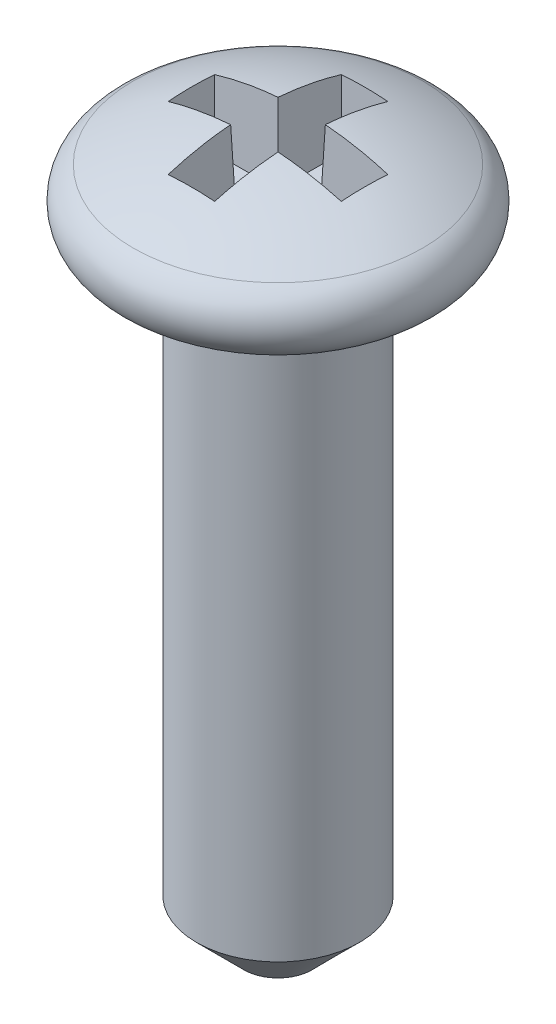
ISO-10303-21;
HEADER;
FILE_DESCRIPTION(('STEP AP214'),'2;1');
FILE_NAME('part.step','',(''),(''),'','','');
FILE_SCHEMA(('AUTOMOTIVE_DESIGN { 1 0 10303 214 1 1 1 1 }'));
ENDSEC;
DATA;
#1=APPLICATION_CONTEXT('core data for automotive mechanical design processes');
#2=APPLICATION_PROTOCOL_DEFINITION('international standard','automotive_design',2000,#1);
#3=PRODUCT_CONTEXT('',#1,'mechanical');
#4=PRODUCT('Part','Part','',(#3));
#5=PRODUCT_RELATED_PRODUCT_CATEGORY('part','',(#4));
#6=PRODUCT_DEFINITION_FORMATION('','',#4);
#7=PRODUCT_DEFINITION_CONTEXT('part definition',#1,'design');
#8=PRODUCT_DEFINITION('design','',#6,#7);
#9=PRODUCT_DEFINITION_SHAPE('','',#8);
#10=(LENGTH_UNIT() NAMED_UNIT(*) SI_UNIT(.MILLI.,.METRE.));
#11=(NAMED_UNIT(*) PLANE_ANGLE_UNIT() SI_UNIT($,.RADIAN.));
#12=(NAMED_UNIT(*) SI_UNIT($,.STERADIAN.) SOLID_ANGLE_UNIT());
#13=UNCERTAINTY_MEASURE_WITH_UNIT(LENGTH_MEASURE(1.E-05),#10,'distance_accuracy_value','');
#14=(GEOMETRIC_REPRESENTATION_CONTEXT(3) GLOBAL_UNCERTAINTY_ASSIGNED_CONTEXT((#13)) GLOBAL_UNIT_ASSIGNED_CONTEXT((#10,
#11,#12)) REPRESENTATION_CONTEXT('',''));
#15=CARTESIAN_POINT('',(0.,0.,0.));
#16=DIRECTION('',(0.,0.,1.));
#17=DIRECTION('',(1.,0.,0.));
#18=AXIS2_PLACEMENT_3D('',#15,#16,#17);
#19=CARTESIAN_POINT('',(0.,10.2362,0.));
#20=DIRECTION('',(0.,1.,0.));
#21=DIRECTION('',(0.,0.,1.));
#22=AXIS2_PLACEMENT_3D('',#19,#20,#21);
#23=PLANE('',#22);
#24=DIRECTION('',(0.,0.,1.));
#25=VECTOR('',#24,1.);
#26=CARTESIAN_POINT('',(0.33665062274548,10.2362,1.397));
#27=LINE('',#26,#25);
#28=CARTESIAN_POINT('',(0.336650622745487,10.2362,1.35265062274548));
#29=VERTEX_POINT('',#28);
#30=CARTESIAN_POINT('',(0.33665062274548,10.2362,0.336650622745488));
#31=VERTEX_POINT('',#30);
#32=EDGE_CURVE('E341',#29,#31,#27,.F.);
#33=ORIENTED_EDGE('',*,*,#32,.T.);
#34=DIRECTION('',(1.,0.,0.));
#35=VECTOR('',#34,1.);
#36=CARTESIAN_POINT('',(0.381,10.2362,0.33665062274548));
#37=LINE('',#36,#35);
#38=CARTESIAN_POINT('',(1.35265062274549,10.2362,0.336650622745481));
#39=VERTEX_POINT('',#38);
#40=EDGE_CURVE('E347',#31,#39,#37,.T.);
#41=ORIENTED_EDGE('',*,*,#40,.T.);
#42=DIRECTION('',(0.,0.,1.));
#43=VECTOR('',#42,1.);
#44=CARTESIAN_POINT('',(1.35265062274548,10.2362,0.381));
#45=LINE('',#44,#43);
#46=CARTESIAN_POINT('',(1.35265062274548,10.2362,-0.336650622745487));
#47=VERTEX_POINT('',#46);
#48=EDGE_CURVE('E300',#39,#47,#45,.F.);
#49=ORIENTED_EDGE('',*,*,#48,.T.);
#50=DIRECTION('',(1.,0.,0.));
#51=VECTOR('',#50,1.);
#52=CARTESIAN_POINT('',(1.397,10.2362,-0.33665062274548));
#53=LINE('',#52,#51);
#54=CARTESIAN_POINT('',(0.336650622745481,10.2362,-0.336650622745484));
#55=VERTEX_POINT('',#54);
#56=EDGE_CURVE('E130',#47,#55,#53,.F.);
#57=ORIENTED_EDGE('',*,*,#56,.T.);
#58=DIRECTION('',(0.,0.,1.));
#59=VECTOR('',#58,1.);
#60=CARTESIAN_POINT('',(0.33665062274548,10.2362,-0.381));
#61=LINE('',#60,#59);
#62=CARTESIAN_POINT('',(0.33665062274548,10.2362,-1.35265062274548));
#63=VERTEX_POINT('',#62);
#64=EDGE_CURVE('E127',#55,#63,#61,.F.);
#65=ORIENTED_EDGE('',*,*,#64,.T.);
#66=DIRECTION('',(1.,0.,0.));
#67=VECTOR('',#66,1.);
#68=CARTESIAN_POINT('',(0.381,10.2362,-1.35265062274548));
#69=LINE('',#68,#67);
#70=CARTESIAN_POINT('',(-0.336650622745485,10.2362,-1.35265062274548));
#71=VERTEX_POINT('',#70);
#72=EDGE_CURVE('E148',#63,#71,#69,.F.);
#73=ORIENTED_EDGE('',*,*,#72,.T.);
#74=DIRECTION('',(0.,0.,1.));
#75=VECTOR('',#74,1.);
#76=CARTESIAN_POINT('',(-0.33665062274548,10.2362,-1.397));
#77=LINE('',#76,#75);
#78=CARTESIAN_POINT('',(-0.33665062274548,10.2362,-0.336650622745488));
#79=VERTEX_POINT('',#78);
#80=EDGE_CURVE('E190',#71,#79,#77,.T.);
#81=ORIENTED_EDGE('',*,*,#80,.T.);
#82=DIRECTION('',(1.,0.,0.));
#83=VECTOR('',#82,1.);
#84=CARTESIAN_POINT('',(-0.381,10.2362,-0.33665062274548));
#85=LINE('',#84,#83);
#86=CARTESIAN_POINT('',(-1.35265062274549,10.2362,-0.33665062274548));
#87=VERTEX_POINT('',#86);
#88=EDGE_CURVE('E195',#79,#87,#85,.F.);
#89=ORIENTED_EDGE('',*,*,#88,.T.);
#90=DIRECTION('',(0.,0.,1.));
#91=VECTOR('',#90,1.);
#92=CARTESIAN_POINT('',(-1.35265062274548,10.2362,-0.381));
#93=LINE('',#92,#91);
#94=CARTESIAN_POINT('',(-1.35265062274548,10.2362,0.336650622745487));
#95=VERTEX_POINT('',#94);
#96=EDGE_CURVE('E200',#87,#95,#93,.T.);
#97=ORIENTED_EDGE('',*,*,#96,.T.);
#98=DIRECTION('',(1.,0.,0.));
#99=VECTOR('',#98,1.);
#100=CARTESIAN_POINT('',(-1.397,10.2362,0.33665062274548));
#101=LINE('',#100,#99);
#102=CARTESIAN_POINT('',(-0.336650622745488,10.2362,0.33665062274548));
#103=VERTEX_POINT('',#102);
#104=EDGE_CURVE('E323',#95,#103,#101,.T.);
#105=ORIENTED_EDGE('',*,*,#104,.T.);
#106=DIRECTION('',(0.,0.,1.));
#107=VECTOR('',#106,1.);
#108=CARTESIAN_POINT('',(-0.33665062274548,10.2362,0.381));
#109=LINE('',#108,#107);
#110=CARTESIAN_POINT('',(-0.33665062274548,10.2362,1.35265062274549));
#111=VERTEX_POINT('',#110);
#112=EDGE_CURVE('E329',#103,#111,#109,.T.);
#113=ORIENTED_EDGE('',*,*,#112,.T.);
#114=DIRECTION('',(1.,0.,0.));
#115=VECTOR('',#114,1.);
#116=CARTESIAN_POINT('',(-0.381,10.2362,1.35265062274548));
#117=LINE('',#116,#115);
#118=EDGE_CURVE('E335',#111,#29,#117,.T.);
#119=ORIENTED_EDGE('',*,*,#118,.T.);
#120=EDGE_LOOP('',(#33,#41,#49,#57,#65,#73,#81,#89,#97,#105,#113,#119));
#121=FACE_BOUND('',#120,.T.);
#122=ADVANCED_FACE('F15',(#121),#23,.T.);
#123=CARTESIAN_POINT('',(0.381,11.5062,-0.381));
#124=DIRECTION('',(0.999390827019096,-0.034899496702501,0.));
#125=DIRECTION('',(0.034899496702501,0.999390827019096,0.));
#126=AXIS2_PLACEMENT_3D('',#123,#124,#125);
#127=PLANE('',#126);
#128=DIRECTION('',(0.0348782627423748,0.998782765958718,-0.0348782627423746));
#129=VECTOR('',#128,1.);
#130=CARTESIAN_POINT('',(0.336650622745481,10.2362,-0.33665062274548));
#131=LINE('',#130,#129);
#132=CARTESIAN_POINT('',(0.379970746913043,11.4767260479097,-0.379970746913043));
#133=VERTEX_POINT('',#132);
#134=EDGE_CURVE('E124',#55,#133,#131,.T.);
#135=ORIENTED_EDGE('',*,*,#134,.T.);
#136=CARTESIAN_POINT('',(0.373478376351118,11.2908088800918,-1.38947837635112));
#137=CARTESIAN_POINT('',(0.375176080368759,11.3394247623405,-1.22447785640432));
#138=CARTESIAN_POINT('',(0.376565963257741,11.379225800783,-1.05785196064441));
#139=CARTESIAN_POINT('',(0.378730086778386,11.4411981900556,-0.721349417498387));
#140=CARTESIAN_POINT('',(0.379504327410048,11.4633695408857,-0.551472770112268));
#141=CARTESIAN_POINT('',(0.379970746913051,11.4767260479097,-0.379970746913042));
#142=B_SPLINE_CURVE_WITH_KNOTS('',3,(#136,#137,#138,#139,#140,#141),.UNSPECIFIED.,.F.,.F.,(4,2,
4),(0.,0.513957383602987,1.02791476720597),.UNSPECIFIED.);
#143=CARTESIAN_POINT('',(0.373478376351117,11.2908088800918,-1.38947837635112));
#144=VERTEX_POINT('',#143);
#145=EDGE_CURVE('E121',#144,#133,#142,.T.);
#146=ORIENTED_EDGE('',*,*,#145,.F.);
#147=DIRECTION('',(-0.0348782627423746,-0.998782765958718,0.0348782627423746));
#148=VECTOR('',#147,1.);
#149=CARTESIAN_POINT('',(0.373478376351117,11.2908088800918,-1.38947837635112));
#150=LINE('',#149,#148);
#151=EDGE_CURVE('E151',#144,#63,#150,.T.);
#152=ORIENTED_EDGE('',*,*,#151,.T.);
#153=ORIENTED_EDGE('',*,*,#64,.F.);
#154=EDGE_LOOP('',(#135,#146,#152,#153));
#155=FACE_BOUND('',#154,.T.);
#156=ADVANCED_FACE('F126',(#155),#127,.F.);
#157=CARTESIAN_POINT('',(1.397,11.5062,-0.381));
#158=DIRECTION('',(0.,-0.034899496702501,-0.999390827019096));
#159=DIRECTION('',(0.,0.999390827019096,-0.034899496702501));
#160=AXIS2_PLACEMENT_3D('',#157,#158,#159);
#161=PLANE('',#160);
#162=DIRECTION('',(0.0348782627423746,0.998782765958718,-0.034878262742374));
#163=VECTOR('',#162,1.);
#164=CARTESIAN_POINT('',(1.35265062274548,10.2362,-0.33665062274549));
#165=LINE('',#164,#163);
#166=CARTESIAN_POINT('',(1.38947837635112,11.2908088800918,-0.373478376351126));
#167=VERTEX_POINT('',#166);
#168=EDGE_CURVE('E136',#47,#167,#165,.T.);
#169=ORIENTED_EDGE('',*,*,#168,.T.);
#170=CARTESIAN_POINT('',(0.379970746913042,11.4767260479097,-0.379970746913042));
#171=CARTESIAN_POINT('',(0.551472770112267,11.4633695408857,-0.379504327410043));
#172=CARTESIAN_POINT('',(0.721349417498385,11.4411981900556,-0.378730086778384));
#173=CARTESIAN_POINT('',(1.05785196064441,11.379225800783,-0.376565963257743));
#174=CARTESIAN_POINT('',(1.22447785640432,11.3394247623405,-0.375176080368762));
#175=CARTESIAN_POINT('',(1.38947837635112,11.2908088800918,-0.37347837635112));
#176=B_SPLINE_CURVE_WITH_KNOTS('',3,(#170,#171,#172,#173,#174,#175),.UNSPECIFIED.,.F.,.F.,(4,2,
4),(0.,0.513957383602985,1.02791476720597),.UNSPECIFIED.);
#177=EDGE_CURVE('E133',#133,#167,#176,.T.);
#178=ORIENTED_EDGE('',*,*,#177,.F.);
#179=ORIENTED_EDGE('',*,*,#134,.F.);
#180=ORIENTED_EDGE('',*,*,#56,.F.);
#181=EDGE_LOOP('',(#169,#178,#179,#180));
#182=FACE_BOUND('',#181,.T.);
#183=ADVANCED_FACE('F134',(#182),#161,.F.);
#184=CARTESIAN_POINT('',(1.397,11.5062,0.381));
#185=DIRECTION('',(0.999390827019096,-0.034899496702501,0.));
#186=DIRECTION('',(0.034899496702501,0.999390827019096,0.));
#187=AXIS2_PLACEMENT_3D('',#184,#185,#186);
#188=PLANE('',#187);
#189=DIRECTION('',(0.0348782627423739,0.998782765958718,0.0348782627423746));
#190=VECTOR('',#189,1.);
#191=CARTESIAN_POINT('',(1.35265062274549,10.2362,0.336650622745481));
#192=LINE('',#191,#190);
#193=CARTESIAN_POINT('',(1.38947837635112,11.2908088800918,0.373478376351117));
#194=VERTEX_POINT('',#193);
#195=EDGE_CURVE('E350',#39,#194,#192,.T.);
#196=ORIENTED_EDGE('',*,*,#195,.T.);
#197=CARTESIAN_POINT('',(1.3899907102025,11.3054802020253,0.));
#198=CARTESIAN_POINT('',(1.38999061133248,11.3054773707585,0.187027594424087));
#199=CARTESIAN_POINT('',(1.38947837635112,11.2908088800918,0.373478376351117));
#200=B_SPLINE_CURVE_WITH_KNOTS('',2,(#197,#198,#199),.UNSPECIFIED.,.F.,.F.,(3,3),(0.,1.),.UNSPECIFIED.);
#201=CARTESIAN_POINT('',(1.3899907102025,11.3054802020253,0.));
#202=VERTEX_POINT('',#201);
#203=EDGE_CURVE('E284',#202,#194,#200,.T.);
#204=ORIENTED_EDGE('',*,*,#203,.F.);
#205=CARTESIAN_POINT('',(1.38947837635112,11.2908088800918,-0.373478376351126));
#206=CARTESIAN_POINT('',(1.38999061133248,11.3054773707585,-0.187027594424157));
#207=CARTESIAN_POINT('',(1.3899907102025,11.3054802020253,0.));
#208=B_SPLINE_CURVE_WITH_KNOTS('',2,(#205,#206,#207),.UNSPECIFIED.,.F.,.F.,(3,3),(0.,1.),.UNSPECIFIED.);
#209=EDGE_CURVE('E140',#167,#202,#208,.T.);
#210=ORIENTED_EDGE('',*,*,#209,.F.);
#211=ORIENTED_EDGE('',*,*,#168,.F.);
#212=ORIENTED_EDGE('',*,*,#48,.F.);
#213=EDGE_LOOP('',(#196,#204,#210,#211,#212));
#214=FACE_BOUND('',#213,.T.);
#215=ADVANCED_FACE('F276',(#214),#188,.F.);
#216=CARTESIAN_POINT('',(0.381,11.5062,0.381));
#217=DIRECTION('',(0.,-0.034899496702501,0.999390827019096));
#218=DIRECTION('',(0.,-0.999390827019096,-0.034899496702501));
#219=AXIS2_PLACEMENT_3D('',#216,#217,#218);
#220=PLANE('',#219);
#221=DIRECTION('',(0.0348782627423746,0.998782765958718,0.034878262742368));
#222=VECTOR('',#221,1.);
#223=CARTESIAN_POINT('',(0.33665062274548,10.2362,0.336650622745491));
#224=LINE('',#223,#222);
#225=CARTESIAN_POINT('',(0.379970746913042,11.4767260479097,0.379970746913045));
#226=VERTEX_POINT('',#225);
#227=EDGE_CURVE('E344',#31,#226,#224,.T.);
#228=ORIENTED_EDGE('',*,*,#227,.T.);
#229=CARTESIAN_POINT('',(1.38947837635112,11.2908088800918,0.373478376351117));
#230=CARTESIAN_POINT('',(1.22447785640434,11.3394247623405,0.375176080368769));
#231=CARTESIAN_POINT('',(1.05785196064444,11.379225800783,0.376565963257751));
#232=CARTESIAN_POINT('',(0.721349417498445,11.4411981900556,0.378730086778376));
#233=CARTESIAN_POINT('',(0.55147277011234,11.4633695408857,0.379504327410018));
#234=CARTESIAN_POINT('',(0.379970746913129,11.4767260479097,0.379970746912991));
#235=B_SPLINE_CURVE_WITH_KNOTS('',3,(#229,#230,#231,#232,#233,#234),.UNSPECIFIED.,.F.,.F.,(4,2,
4),(0.,0.513957383602946,1.02791476720589),.UNSPECIFIED.);
#236=EDGE_CURVE('E279',#194,#226,#235,.T.);
#237=ORIENTED_EDGE('',*,*,#236,.F.);
#238=ORIENTED_EDGE('',*,*,#195,.F.);
#239=ORIENTED_EDGE('',*,*,#40,.F.);
#240=EDGE_LOOP('',(#228,#237,#238,#239));
#241=FACE_BOUND('',#240,.T.);
#242=ADVANCED_FACE('F271',(#241),#220,.F.);
#243=CARTESIAN_POINT('',(0.381,11.5062,1.397));
#244=DIRECTION('',(0.999390827019096,-0.034899496702501,0.));
#245=DIRECTION('',(0.034899496702501,0.999390827019096,0.));
#246=AXIS2_PLACEMENT_3D('',#243,#244,#245);
#247=PLANE('',#246);
#248=DIRECTION('',(0.0348782627423741,0.998782765958718,0.0348782627423747));
#249=VECTOR('',#248,1.);
#250=CARTESIAN_POINT('',(0.33665062274549,10.2362,1.35265062274548));
#251=LINE('',#250,#249);
#252=CARTESIAN_POINT('',(0.373478376351126,11.2908088800918,1.38947837635112));
#253=VERTEX_POINT('',#252);
#254=EDGE_CURVE('E338',#29,#253,#251,.T.);
#255=ORIENTED_EDGE('',*,*,#254,.T.);
#256=CARTESIAN_POINT('',(0.379970746913042,11.4767260479097,0.379970746913044));
#257=CARTESIAN_POINT('',(0.379504327410044,11.4633695408857,0.551472770112269));
#258=CARTESIAN_POINT('',(0.378730086778384,11.4411981900556,0.721349417498387));
#259=CARTESIAN_POINT('',(0.376565963257743,11.379225800783,1.05785196064441));
#260=CARTESIAN_POINT('',(0.375176080368761,11.3394247623405,1.22447785640432));
#261=CARTESIAN_POINT('',(0.373478376351118,11.2908088800918,1.38947837635112));
#262=B_SPLINE_CURVE_WITH_KNOTS('',3,(#256,#257,#258,#259,#260,#261),.UNSPECIFIED.,.F.,.F.,(4,2,
4),(0.,0.513957383602984,1.02791476720597),.UNSPECIFIED.);
#263=EDGE_CURVE('E258',#226,#253,#262,.T.);
#264=ORIENTED_EDGE('',*,*,#263,.F.);
#265=ORIENTED_EDGE('',*,*,#227,.F.);
#266=ORIENTED_EDGE('',*,*,#32,.F.);
#267=EDGE_LOOP('',(#255,#264,#265,#266));
#268=FACE_BOUND('',#267,.T.);
#269=ADVANCED_FACE('F266',(#268),#247,.F.);
#270=CARTESIAN_POINT('',(-0.381,11.5062,1.397));
#271=DIRECTION('',(0.,-0.034899496702501,0.999390827019096));
#272=DIRECTION('',(0.,-0.999390827019096,-0.034899496702501));
#273=AXIS2_PLACEMENT_3D('',#270,#271,#272);
#274=PLANE('',#273);
#275=DIRECTION('',(-0.0348782627423746,0.998782765958718,0.0348782627423739));
#276=VECTOR('',#275,1.);
#277=CARTESIAN_POINT('',(-0.33665062274548,10.2362,1.35265062274549));
#278=LINE('',#277,#276);
#279=CARTESIAN_POINT('',(-0.373478376351117,11.2908088800918,1.38947837635112));
#280=VERTEX_POINT('',#279);
#281=EDGE_CURVE('E332',#111,#280,#278,.T.);
#282=ORIENTED_EDGE('',*,*,#281,.T.);
#283=CARTESIAN_POINT('',(0.373478376351126,11.2908088800918,1.38947837635112));
#284=CARTESIAN_POINT('',(0.248985584234086,11.3005897613808,1.38981993225204));
#285=CARTESIAN_POINT('',(0.124492792117045,11.3054802020253,1.3899907102025));
#286=CARTESIAN_POINT('',(-0.124492792117036,11.3054802020253,1.3899907102025));
#287=CARTESIAN_POINT('',(-0.248985584234077,11.3005897613808,1.38981993225204));
#288=CARTESIAN_POINT('',(-0.373478376351117,11.2908088800918,1.38947837635112));
#289=B_SPLINE_CURVE_WITH_KNOTS('',3,(#283,#284,#285,#286,#287,#288),.UNSPECIFIED.,.F.,.F.,(4,2,
4),(0.,0.373766782599955,0.747533565199911),.UNSPECIFIED.);
#290=EDGE_CURVE('E252',#253,#280,#289,.T.);
#291=ORIENTED_EDGE('',*,*,#290,.F.);
#292=ORIENTED_EDGE('',*,*,#254,.F.);
#293=ORIENTED_EDGE('',*,*,#118,.F.);
#294=EDGE_LOOP('',(#282,#291,#292,#293));
#295=FACE_BOUND('',#294,.T.);
#296=ADVANCED_FACE('F263',(#295),#274,.F.);
#297=CARTESIAN_POINT('',(-0.381,11.5062,0.381));
#298=DIRECTION('',(-0.999390827019096,-0.034899496702501,0.));
#299=DIRECTION('',(0.034899496702501,-0.999390827019096,0.));
#300=AXIS2_PLACEMENT_3D('',#297,#298,#299);
#301=PLANE('',#300);
#302=DIRECTION('',(-0.034878262742368,0.998782765958718,0.0348782627423746));
#303=VECTOR('',#302,1.);
#304=CARTESIAN_POINT('',(-0.336650622745491,10.2362,0.33665062274548));
#305=LINE('',#304,#303);
#306=CARTESIAN_POINT('',(-0.379970746913045,11.4767260479097,0.379970746913043));
#307=VERTEX_POINT('',#306);
#308=EDGE_CURVE('E326',#103,#307,#305,.T.);
#309=ORIENTED_EDGE('',*,*,#308,.T.);
#310=CARTESIAN_POINT('',(-0.373478376351117,11.2908088800918,1.38947837635112));
#311=CARTESIAN_POINT('',(-0.37517608036876,11.3394247623405,1.22447785640432));
#312=CARTESIAN_POINT('',(-0.376565963257743,11.379225800783,1.05785196064442));
#313=CARTESIAN_POINT('',(-0.378730086778385,11.4411981900556,0.721349417498389));
#314=CARTESIAN_POINT('',(-0.379504327410044,11.4633695408857,0.551472770112269));
#315=CARTESIAN_POINT('',(-0.379970746913043,11.4767260479097,0.379970746913043));
#316=B_SPLINE_CURVE_WITH_KNOTS('',3,(#310,#311,#312,#313,#314,#315),.UNSPECIFIED.,.F.,.F.,(4,2,
4),(0.,0.513957383602989,1.02791476720598),.UNSPECIFIED.);
#317=EDGE_CURVE('E241',#280,#307,#316,.T.);
#318=ORIENTED_EDGE('',*,*,#317,.F.);
#319=ORIENTED_EDGE('',*,*,#281,.F.);
#320=ORIENTED_EDGE('',*,*,#112,.F.);
#321=EDGE_LOOP('',(#309,#318,#319,#320));
#322=FACE_BOUND('',#321,.T.);
#323=ADVANCED_FACE('F230',(#322),#301,.F.);
#324=CARTESIAN_POINT('',(-1.397,11.5062,0.381));
#325=DIRECTION('',(0.,-0.034899496702501,0.999390827019096));
#326=DIRECTION('',(0.,-0.999390827019096,-0.034899496702501));
#327=AXIS2_PLACEMENT_3D('',#324,#325,#326);
#328=PLANE('',#327);
#329=DIRECTION('',(-0.0348782627423746,0.998782765958718,0.034878262742374));
#330=VECTOR('',#329,1.);
#331=CARTESIAN_POINT('',(-1.35265062274548,10.2362,0.33665062274549));
#332=LINE('',#331,#330);
#333=CARTESIAN_POINT('',(-1.38947837635112,11.2908088800918,0.373478376351126));
#334=VERTEX_POINT('',#333);
#335=EDGE_CURVE('E320',#95,#334,#332,.T.);
#336=ORIENTED_EDGE('',*,*,#335,.T.);
#337=CARTESIAN_POINT('',(-0.379970746913044,11.4767260479097,0.379970746913043));
#338=CARTESIAN_POINT('',(-0.551472770112269,11.4633695408857,0.379504327410044));
#339=CARTESIAN_POINT('',(-0.721349417498387,11.4411981900556,0.378730086778385));
#340=CARTESIAN_POINT('',(-1.05785196064441,11.379225800783,0.376565963257743));
#341=CARTESIAN_POINT('',(-1.22447785640432,11.3394247623405,0.37517608036876));
#342=CARTESIAN_POINT('',(-1.38947837635112,11.2908088800918,0.373478376351117));
#343=B_SPLINE_CURVE_WITH_KNOTS('',3,(#337,#338,#339,#340,#341,#342),.UNSPECIFIED.,.F.,.F.,(4,2,
4),(0.,0.513957383602984,1.02791476720597),.UNSPECIFIED.);
#344=EDGE_CURVE('E209',#307,#334,#343,.T.);
#345=ORIENTED_EDGE('',*,*,#344,.F.);
#346=ORIENTED_EDGE('',*,*,#308,.F.);
#347=ORIENTED_EDGE('',*,*,#104,.F.);
#348=EDGE_LOOP('',(#336,#345,#346,#347));
#349=FACE_BOUND('',#348,.T.);
#350=ADVANCED_FACE('F223',(#349),#328,.F.);
#351=CARTESIAN_POINT('',(-1.397,11.5062,-0.381));
#352=DIRECTION('',(-0.999390827019096,-0.034899496702501,0.));
#353=DIRECTION('',(0.034899496702501,-0.999390827019096,0.));
#354=AXIS2_PLACEMENT_3D('',#351,#352,#353);
#355=PLANE('',#354);
#356=DIRECTION('',(-0.0348782627423739,0.998782765958718,-0.0348782627423746));
#357=VECTOR('',#356,1.);
#358=CARTESIAN_POINT('',(-1.35265062274549,10.2362,-0.33665062274548));
#359=LINE('',#358,#357);
#360=CARTESIAN_POINT('',(-1.38947837635112,11.2908088800918,-0.373478376351118));
#361=VERTEX_POINT('',#360);
#362=EDGE_CURVE('E198',#87,#361,#359,.T.);
#363=ORIENTED_EDGE('',*,*,#362,.T.);
#364=CARTESIAN_POINT('',(-1.3899907102025,11.3054802020253,0.));
#365=CARTESIAN_POINT('',(-1.38999061133248,11.3054773707585,-0.187027594424026));
#366=CARTESIAN_POINT('',(-1.38947837635112,11.2908088800918,-0.373478376351117));
#367=B_SPLINE_CURVE_WITH_KNOTS('',2,(#364,#365,#366),.UNSPECIFIED.,.F.,.F.,(3,3),(0.,1.),.UNSPECIFIED.);
#368=CARTESIAN_POINT('',(-1.3899907102025,11.3054802020253,0.));
#369=VERTEX_POINT('',#368);
#370=EDGE_CURVE('E208',#369,#361,#367,.T.);
#371=ORIENTED_EDGE('',*,*,#370,.F.);
#372=CARTESIAN_POINT('',(-1.38947837635112,11.2908088800918,0.373478376351126));
#373=CARTESIAN_POINT('',(-1.38999061133248,11.3054773707585,0.187027594424156));
#374=CARTESIAN_POINT('',(-1.3899907102025,11.3054802020253,0.));
#375=B_SPLINE_CURVE_WITH_KNOTS('',2,(#372,#373,#374),.UNSPECIFIED.,.F.,.F.,(3,3),(0.,1.),.UNSPECIFIED.);
#376=EDGE_CURVE('E203',#334,#369,#375,.T.);
#377=ORIENTED_EDGE('',*,*,#376,.F.);
#378=ORIENTED_EDGE('',*,*,#335,.F.);
#379=ORIENTED_EDGE('',*,*,#96,.F.);
#380=EDGE_LOOP('',(#363,#371,#377,#378,#379));
#381=FACE_BOUND('',#380,.T.);
#382=ADVANCED_FACE('F212',(#381),#355,.F.);
#383=CARTESIAN_POINT('',(-0.381,11.5062,-0.381));
#384=DIRECTION('',(0.,-0.034899496702501,-0.999390827019096));
#385=DIRECTION('',(0.,0.999390827019096,-0.034899496702501));
#386=AXIS2_PLACEMENT_3D('',#383,#384,#385);
#387=PLANE('',#386);
#388=DIRECTION('',(-0.0348782627423746,0.998782765958718,-0.0348782627423679));
#389=VECTOR('',#388,1.);
#390=CARTESIAN_POINT('',(-0.33665062274548,10.2362,-0.336650622745491));
#391=LINE('',#390,#389);
#392=CARTESIAN_POINT('',(-0.379970746913043,11.4767260479097,-0.379970746913046));
#393=VERTEX_POINT('',#392);
#394=EDGE_CURVE('E193',#79,#393,#391,.T.);
#395=ORIENTED_EDGE('',*,*,#394,.T.);
#396=CARTESIAN_POINT('',(-1.38947837635112,11.2908088800918,-0.373478376351119));
#397=CARTESIAN_POINT('',(-1.22447785640434,11.3394247623405,-0.37517608036877));
#398=CARTESIAN_POINT('',(-1.05785196064444,11.379225800783,-0.376565963257752));
#399=CARTESIAN_POINT('',(-0.721349417498446,11.4411981900556,-0.378730086778375));
#400=CARTESIAN_POINT('',(-0.551472770112341,11.4633695408857,-0.379504327410017));
#401=CARTESIAN_POINT('',(-0.37997074691313,11.4767260479097,-0.379970746912989));
#402=B_SPLINE_CURVE_WITH_KNOTS('',3,(#396,#397,#398,#399,#400,#401),.UNSPECIFIED.,.F.,.F.,(4,2,
4),(0.,0.513957383602945,1.02791476720589),.UNSPECIFIED.);
#403=EDGE_CURVE('E242',#361,#393,#402,.T.);
#404=ORIENTED_EDGE('',*,*,#403,.F.);
#405=ORIENTED_EDGE('',*,*,#362,.F.);
#406=ORIENTED_EDGE('',*,*,#88,.F.);
#407=EDGE_LOOP('',(#395,#404,#405,#406));
#408=FACE_BOUND('',#407,.T.);
#409=ADVANCED_FACE('F222',(#408),#387,.F.);
#410=CARTESIAN_POINT('',(-0.381,11.5062,-1.397));
#411=DIRECTION('',(-0.999390827019096,-0.034899496702501,0.));
#412=DIRECTION('',(0.034899496702501,-0.999390827019096,0.));
#413=AXIS2_PLACEMENT_3D('',#410,#411,#412);
#414=PLANE('',#413);
#415=DIRECTION('',(-0.0348782627423741,0.998782765958718,-0.0348782627423747));
#416=VECTOR('',#415,1.);
#417=CARTESIAN_POINT('',(-0.33665062274549,10.2362,-1.35265062274548));
#418=LINE('',#417,#416);
#419=CARTESIAN_POINT('',(-0.373478376351125,11.2908088800918,-1.38947837635112));
#420=VERTEX_POINT('',#419);
#421=EDGE_CURVE('E186',#71,#420,#418,.T.);
#422=ORIENTED_EDGE('',*,*,#421,.T.);
#423=CARTESIAN_POINT('',(-0.379970746913043,11.4767260479097,-0.379970746913047));
#424=CARTESIAN_POINT('',(-0.379504327410044,11.4633695408857,-0.551472770112271));
#425=CARTESIAN_POINT('',(-0.378730086778385,11.4411981900556,-0.721349417498388));
#426=CARTESIAN_POINT('',(-0.376565963257743,11.379225800783,-1.05785196064441));
#427=CARTESIAN_POINT('',(-0.37517608036876,11.3394247623405,-1.22447785640432));
#428=CARTESIAN_POINT('',(-0.373478376351117,11.2908088800918,-1.38947837635112));
#429=B_SPLINE_CURVE_WITH_KNOTS('',3,(#423,#424,#425,#426,#427,#428),.UNSPECIFIED.,.F.,.F.,(4,2,
4),(0.,0.513957383602983,1.02791476720597),.UNSPECIFIED.);
#430=EDGE_CURVE('E369',#393,#420,#429,.T.);
#431=ORIENTED_EDGE('',*,*,#430,.F.);
#432=ORIENTED_EDGE('',*,*,#394,.F.);
#433=ORIENTED_EDGE('',*,*,#80,.F.);
#434=EDGE_LOOP('',(#422,#431,#432,#433));
#435=FACE_BOUND('',#434,.T.);
#436=ADVANCED_FACE('F373',(#435),#414,.F.);
#437=CARTESIAN_POINT('',(0.381,11.5062,-1.397));
#438=DIRECTION('',(0.,-0.034899496702501,-0.999390827019096));
#439=DIRECTION('',(0.,0.999390827019096,-0.034899496702501));
#440=AXIS2_PLACEMENT_3D('',#437,#438,#439);
#441=PLANE('',#440);
#442=ORIENTED_EDGE('',*,*,#151,.F.);
#443=CARTESIAN_POINT('',(-0.373478376351124,11.2908088800918,-1.38947837635111));
#444=CARTESIAN_POINT('',(-0.248985584234083,11.3005897613808,-1.38981993225204));
#445=CARTESIAN_POINT('',(-0.124492792117043,11.3054802020253,-1.3899907102025));
#446=CARTESIAN_POINT('',(0.124492792117037,11.3054802020253,-1.3899907102025));
#447=CARTESIAN_POINT('',(0.248985584234077,11.3005897613808,-1.38981993225204));
#448=CARTESIAN_POINT('',(0.373478376351117,11.2908088800918,-1.38947837635111));
#449=B_SPLINE_CURVE_WITH_KNOTS('',3,(#443,#444,#445,#446,#447,#448),.UNSPECIFIED.,.F.,.F.,(4,2,
4),(0.,0.373766782599954,0.747533565199908),.UNSPECIFIED.);
#450=EDGE_CURVE('E147',#420,#144,#449,.T.);
#451=ORIENTED_EDGE('',*,*,#450,.F.);
#452=ORIENTED_EDGE('',*,*,#421,.F.);
#453=ORIENTED_EDGE('',*,*,#72,.F.);
#454=EDGE_LOOP('',(#442,#451,#452,#453));
#455=FACE_BOUND('',#454,.T.);
#456=ADVANCED_FACE('F170',(#455),#441,.F.);
#457=CARTESIAN_POINT('',(0.,6.59297611364203,0.));
#458=DIRECTION('',(1.,0.,0.));
#459=DIRECTION('',(0.,1.,0.));
#460=AXIS2_PLACEMENT_3D('',#457,#458,#459);
#461=SPHERICAL_SURFACE('',#460,4.91322388635797);
#462=ORIENTED_EDGE('',*,*,#430,.T.);
#463=ORIENTED_EDGE('',*,*,#450,.T.);
#464=ORIENTED_EDGE('',*,*,#145,.T.);
#465=ORIENTED_EDGE('',*,*,#177,.T.);
#466=ORIENTED_EDGE('',*,*,#209,.T.);
#467=ORIENTED_EDGE('',*,*,#203,.T.);
#468=ORIENTED_EDGE('',*,*,#236,.T.);
#469=ORIENTED_EDGE('',*,*,#263,.T.);
#470=ORIENTED_EDGE('',*,*,#290,.T.);
#471=ORIENTED_EDGE('',*,*,#317,.T.);
#472=ORIENTED_EDGE('',*,*,#344,.T.);
#473=ORIENTED_EDGE('',*,*,#376,.T.);
#474=ORIENTED_EDGE('',*,*,#370,.T.);
#475=ORIENTED_EDGE('',*,*,#403,.T.);
#476=EDGE_LOOP('',(#462,#463,#464,#465,#466,#467,#468,#469,#470,#471,#472,#473,#474,#475));
#477=FACE_BOUND('',#476,.T.);
#478=CARTESIAN_POINT('',(0.,10.922,0.));
#479=DIRECTION('',(0.,1.,0.));
#480=DIRECTION('',(0.,0.,1.));
#481=AXIS2_PLACEMENT_3D('',#478,#479,#480);
#482=CIRCLE('',#481,2.32364393761624);
#483=CARTESIAN_POINT('',(0.,10.922,2.32364393761624));
#484=VERTEX_POINT('',#483);
#485=EDGE_CURVE('E363',#484,#484,#482,.F.);
#486=ORIENTED_EDGE('',*,*,#485,.F.);
#487=EDGE_LOOP('',(#486));
#488=FACE_BOUND('',#487,.T.);
#489=ADVANCED_FACE('F144',(#477,#488),#461,.T.);
#490=CARTESIAN_POINT('',(0.,10.4223160707723,0.));
#491=DIRECTION('',(0.,1.,0.));
#492=DIRECTION('',(0.,0.,1.));
#493=AXIS2_PLACEMENT_3D('',#490,#491,#492);
#494=TOROIDAL_SURFACE('',#493,2.0554339292277,0.567116070772296);
#495=ORIENTED_EDGE('',*,*,#485,.T.);
#496=EDGE_LOOP('',(#495));
#497=FACE_BOUND('',#496,.T.);
#498=CARTESIAN_POINT('',(0.,9.8552,0.));
#499=DIRECTION('',(0.,1.,0.));
#500=DIRECTION('',(0.,0.,1.));
#501=AXIS2_PLACEMENT_3D('',#498,#499,#500);
#502=CIRCLE('',#501,2.0554339292277);
#503=CARTESIAN_POINT('',(2.0554339292277,9.8552,0.));
#504=VERTEX_POINT('',#503);
#505=CARTESIAN_POINT('',(0.,9.8552,2.0554339292277));
#506=VERTEX_POINT('',#505);
#507=EDGE_CURVE('E365',#504,#506,#502,.F.);
#508=ORIENTED_EDGE('',*,*,#507,.F.);
#509=CARTESIAN_POINT('',(0.,9.8552,0.));
#510=DIRECTION('',(0.,1.,0.));
#511=DIRECTION('',(1.,0.,0.));
#512=AXIS2_PLACEMENT_3D('',#509,#510,#511);
#513=CIRCLE('',#512,2.0554339292277);
#514=CARTESIAN_POINT('',(0.,9.8552,-2.0554339292277));
#515=VERTEX_POINT('',#514);
#516=EDGE_CURVE('E35',#515,#504,#513,.F.);
#517=ORIENTED_EDGE('',*,*,#516,.F.);
#518=CARTESIAN_POINT('',(0.,9.8552,0.));
#519=DIRECTION('',(0.,1.,0.));
#520=DIRECTION('',(0.,0.,-1.));
#521=AXIS2_PLACEMENT_3D('',#518,#519,#520);
#522=CIRCLE('',#521,2.0554339292277);
#523=CARTESIAN_POINT('',(-2.0554339292277,9.8552,0.));
#524=VERTEX_POINT('',#523);
#525=EDGE_CURVE('E446',#524,#515,#522,.F.);
#526=ORIENTED_EDGE('',*,*,#525,.F.);
#527=CARTESIAN_POINT('',(0.,9.8552,0.));
#528=DIRECTION('',(0.,1.,0.));
#529=DIRECTION('',(-1.,0.,0.));
#530=AXIS2_PLACEMENT_3D('',#527,#528,#529);
#531=CIRCLE('',#530,2.0554339292277);
#532=EDGE_CURVE('E445',#506,#524,#531,.F.);
#533=ORIENTED_EDGE('',*,*,#532,.F.);
#534=EDGE_LOOP('',(#508,#517,#526,#533));
#535=FACE_BOUND('',#534,.T.);
#536=ADVANCED_FACE('F169',(#497,#535),#494,.T.);
#537=CARTESIAN_POINT('',(-0.27305,0.,0.));
#538=DIRECTION('',(0.,-1.,0.));
#539=DIRECTION('',(0.,0.,-1.));
#540=AXIS2_PLACEMENT_3D('',#537,#538,#539);
#541=PLANE('',#540);
#542=CARTESIAN_POINT('',(0.,-3.41060513164848E-10,0.));
#543=DIRECTION('',(0.,1.,0.));
#544=DIRECTION('',(0.,0.,1.));
#545=AXIS2_PLACEMENT_3D('',#542,#543,#544);
#546=CIRCLE('',#545,0.546100000292427);
#547=CARTESIAN_POINT('',(0.,-3.41060513164848E-10,0.546100000292427));
#548=VERTEX_POINT('',#547);
#549=EDGE_CURVE('E360',#548,#548,#546,.T.);
#550=ORIENTED_EDGE('',*,*,#549,.F.);
#551=EDGE_LOOP('',(#550));
#552=FACE_BOUND('',#551,.T.);
#553=ADVANCED_FACE('F399',(#552),#541,.T.);
#554=CARTESIAN_POINT('',(-1.68176696461385,9.8552,0.));
#555=DIRECTION('',(0.,-1.,0.));
#556=DIRECTION('',(0.,0.,-1.));
#557=AXIS2_PLACEMENT_3D('',#554,#555,#556);
#558=PLANE('',#557);
#559=CARTESIAN_POINT('',(0.,9.85520000000001,0.));
#560=DIRECTION('',(0.,1.,0.));
#561=DIRECTION('',(0.,0.,1.));
#562=AXIS2_PLACEMENT_3D('',#559,#560,#561);
#563=CIRCLE('',#562,1.3081);
#564=CARTESIAN_POINT('',(0.,9.85520000000001,1.3081));
#565=VERTEX_POINT('',#564);
#566=EDGE_CURVE('E10',#565,#565,#563,.F.);
#567=ORIENTED_EDGE('',*,*,#566,.F.);
#568=EDGE_LOOP('',(#567));
#569=FACE_BOUND('',#568,.T.);
#570=ORIENTED_EDGE('',*,*,#525,.T.);
#571=ORIENTED_EDGE('',*,*,#516,.T.);
#572=ORIENTED_EDGE('',*,*,#507,.T.);
#573=ORIENTED_EDGE('',*,*,#532,.T.);
#574=EDGE_LOOP('',(#570,#571,#572,#573));
#575=FACE_BOUND('',#574,.T.);
#576=ADVANCED_FACE('F392',(#569,#575),#558,.T.);
#577=CARTESIAN_POINT('',(0.,0.762000000349872,0.));
#578=DIRECTION('',(0.,1.,0.));
#579=DIRECTION('',(0.,0.,1.));
#580=AXIS2_PLACEMENT_3D('',#577,#578,#579);
#581=CONICAL_SURFACE('',#580,1.30809999967596,0.785398162539575);
#582=CARTESIAN_POINT('',(0.,0.761999999999998,0.));
#583=DIRECTION('',(0.,1.,0.));
#584=DIRECTION('',(0.,0.,1.));
#585=AXIS2_PLACEMENT_3D('',#582,#583,#584);
#586=CIRCLE('',#585,1.3081);
#587=CARTESIAN_POINT('',(0.,0.761999999999998,1.3081));
#588=VERTEX_POINT('',#587);
#589=EDGE_CURVE('E26',#588,#588,#586,.T.);
#590=ORIENTED_EDGE('',*,*,#589,.F.);
#591=EDGE_LOOP('',(#590));
#592=FACE_BOUND('',#591,.T.);
#593=ORIENTED_EDGE('',*,*,#549,.T.);
#594=EDGE_LOOP('',(#593));
#595=FACE_BOUND('',#594,.T.);
#596=ADVANCED_FACE('F386',(#592,#595),#581,.T.);
#597=CARTESIAN_POINT('',(0.,5.3086,0.));
#598=DIRECTION('',(0.,1.,0.));
#599=DIRECTION('',(0.,0.,1.));
#600=AXIS2_PLACEMENT_3D('',#597,#598,#599);
#601=CYLINDRICAL_SURFACE('',#600,1.3081);
#602=ORIENTED_EDGE('',*,*,#566,.T.);
#603=EDGE_LOOP('',(#602));
#604=FACE_BOUND('',#603,.T.);
#605=ORIENTED_EDGE('',*,*,#589,.T.);
#606=EDGE_LOOP('',(#605));
#607=FACE_BOUND('',#606,.T.);
#608=ADVANCED_FACE('F384',(#604,#607),#601,.T.);
#609=CLOSED_SHELL('',(#122,#156,#183,#215,#242,#269,#296,#323,#350,#382,#409,#436,#456,#489,
#536,#553,#576,#596,#608));
#610=MANIFOLD_SOLID_BREP('B1',#609);
#611=ADVANCED_BREP_SHAPE_REPRESENTATION('',(#18,#610),#14);
#612=SHAPE_DEFINITION_REPRESENTATION(#9,#611);
ENDSEC;
END-ISO-10303-21;
